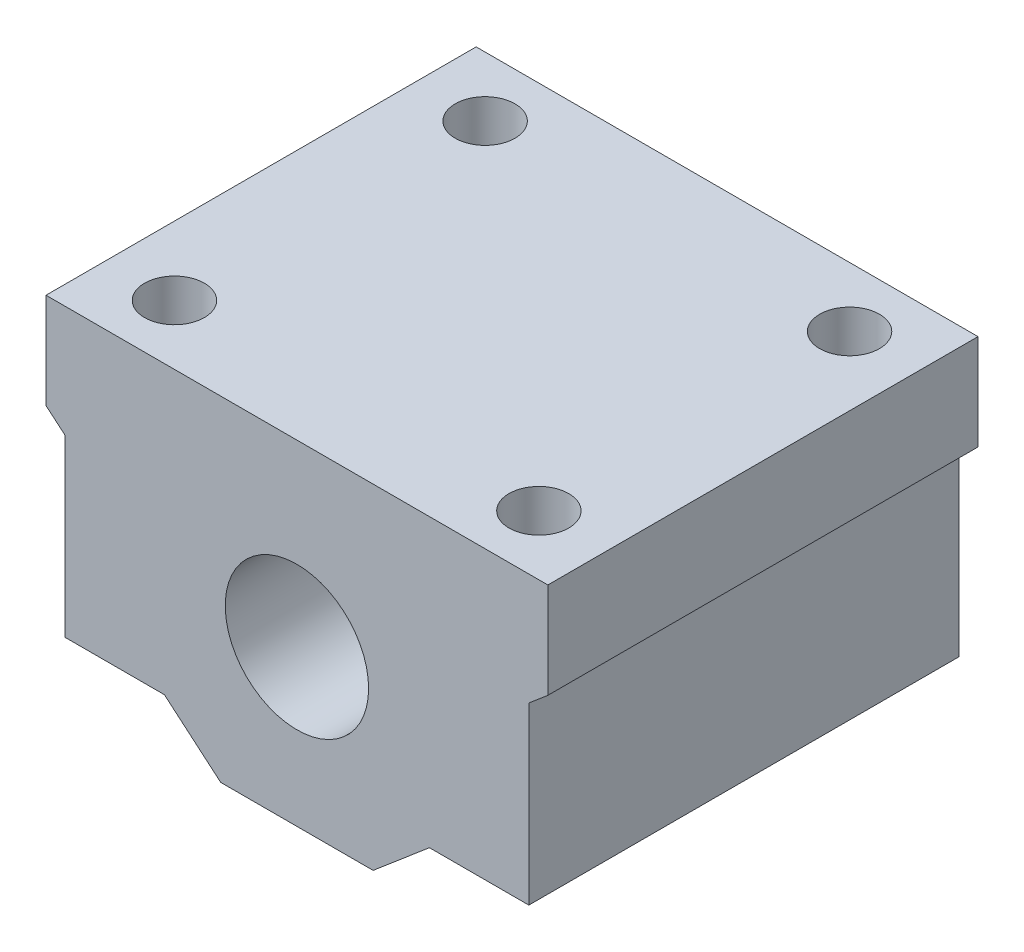
ISO-10303-21;
HEADER;
FILE_DESCRIPTION(('STEP AP214'),'2;1');
FILE_NAME('part.step','',(''),(''),'','','');
FILE_SCHEMA(('AUTOMOTIVE_DESIGN { 1 0 10303 214 1 1 1 1 }'));
ENDSEC;
DATA;
#1=APPLICATION_CONTEXT('core data for automotive mechanical design processes');
#2=APPLICATION_PROTOCOL_DEFINITION('international standard','automotive_design',2000,#1);
#3=PRODUCT_CONTEXT('',#1,'mechanical');
#4=PRODUCT('Part','Part','',(#3));
#5=PRODUCT_RELATED_PRODUCT_CATEGORY('part','',(#4));
#6=PRODUCT_DEFINITION_FORMATION('','',#4);
#7=PRODUCT_DEFINITION_CONTEXT('part definition',#1,'design');
#8=PRODUCT_DEFINITION('design','',#6,#7);
#9=PRODUCT_DEFINITION_SHAPE('','',#8);
#10=(LENGTH_UNIT() NAMED_UNIT(*) SI_UNIT(.MILLI.,.METRE.));
#11=(NAMED_UNIT(*) PLANE_ANGLE_UNIT() SI_UNIT($,.RADIAN.));
#12=(NAMED_UNIT(*) SI_UNIT($,.STERADIAN.) SOLID_ANGLE_UNIT());
#13=UNCERTAINTY_MEASURE_WITH_UNIT(LENGTH_MEASURE(1.E-05),#10,'distance_accuracy_value','');
#14=(GEOMETRIC_REPRESENTATION_CONTEXT(3) GLOBAL_UNCERTAINTY_ASSIGNED_CONTEXT((#13)) GLOBAL_UNIT_ASSIGNED_CONTEXT((#10,
#11,#12)) REPRESENTATION_CONTEXT('',''));
#15=CARTESIAN_POINT('',(0.,0.,0.));
#16=DIRECTION('',(0.,0.,1.));
#17=DIRECTION('',(1.,0.,0.));
#18=AXIS2_PLACEMENT_3D('',#15,#16,#17);
#19=CARTESIAN_POINT('',(-6.37775609988276,-6.01212369315824,36.));
#20=DIRECTION('',(0.647214623965311,0.762307831866787,0.));
#21=DIRECTION('',(-0.762307831866787,0.647214623965311,0.));
#22=AXIS2_PLACEMENT_3D('',#19,#20,#21);
#23=PLANE('',#22);
#24=DIRECTION('',(0.762307831866787,-0.647214623965311,0.));
#25=VECTOR('',#24,1.);
#26=CARTESIAN_POINT('',(-6.37775609988276,-6.01212369315824,0.));
#27=LINE('',#26,#25);
#28=CARTESIAN_POINT('',(-11.0890701131313,-2.01212369315823,0.));
#29=VERTEX_POINT('',#28);
#30=CARTESIAN_POINT('',(-6.37775609988276,-6.01212369315824,0.));
#31=VERTEX_POINT('',#30);
#32=EDGE_CURVE('E166',#29,#31,#27,.T.);
#33=ORIENTED_EDGE('',*,*,#32,.T.);
#34=DIRECTION('',(0.,0.,-1.));
#35=VECTOR('',#34,1.);
#36=CARTESIAN_POINT('',(-6.37775609988276,-6.01212369315824,36.));
#37=LINE('',#36,#35);
#38=CARTESIAN_POINT('',(-6.37775609988276,-6.01212369315824,36.));
#39=VERTEX_POINT('',#38);
#40=EDGE_CURVE('E11',#39,#31,#37,.T.);
#41=ORIENTED_EDGE('',*,*,#40,.F.);
#42=DIRECTION('',(0.762307831866787,-0.647214623965311,0.));
#43=VECTOR('',#42,1.);
#44=CARTESIAN_POINT('',(-6.37775609988276,-6.01212369315824,36.));
#45=LINE('',#44,#43);
#46=CARTESIAN_POINT('',(-11.0890701131313,-2.01212369315823,36.));
#47=VERTEX_POINT('',#46);
#48=EDGE_CURVE('E201',#47,#39,#45,.T.);
#49=ORIENTED_EDGE('',*,*,#48,.F.);
#50=DIRECTION('',(0.,0.,-1.));
#51=VECTOR('',#50,1.);
#52=CARTESIAN_POINT('',(-11.0890701131313,-2.01212369315823,36.));
#53=LINE('',#52,#51);
#54=EDGE_CURVE('E162',#47,#29,#53,.T.);
#55=ORIENTED_EDGE('',*,*,#54,.T.);
#56=EDGE_LOOP('',(#33,#41,#49,#55));
#57=FACE_BOUND('',#56,.T.);
#58=ADVANCED_FACE('F39',(#57),#23,.F.);
#59=CARTESIAN_POINT('',(6.37775609988276,-6.01212369315824,36.));
#60=DIRECTION('',(0.,1.,0.));
#61=DIRECTION('',(0.,0.,1.));
#62=AXIS2_PLACEMENT_3D('',#59,#60,#61);
#63=PLANE('',#62);
#64=DIRECTION('',(1.,0.,0.));
#65=VECTOR('',#64,1.);
#66=CARTESIAN_POINT('',(6.37775609988276,-6.01212369315824,0.));
#67=LINE('',#66,#65);
#68=CARTESIAN_POINT('',(6.37775609988276,-6.01212369315824,0.));
#69=VERTEX_POINT('',#68);
#70=EDGE_CURVE('E170',#31,#69,#67,.T.);
#71=ORIENTED_EDGE('',*,*,#70,.T.);
#72=DIRECTION('',(0.,0.,-1.));
#73=VECTOR('',#72,1.);
#74=CARTESIAN_POINT('',(6.37775609988276,-6.01212369315824,36.));
#75=LINE('',#74,#73);
#76=CARTESIAN_POINT('',(6.37775609988276,-6.01212369315824,36.));
#77=VERTEX_POINT('',#76);
#78=EDGE_CURVE('E49',#77,#69,#75,.T.);
#79=ORIENTED_EDGE('',*,*,#78,.F.);
#80=DIRECTION('',(1.,0.,0.));
#81=VECTOR('',#80,1.);
#82=CARTESIAN_POINT('',(6.37775609988276,-6.01212369315824,36.));
#83=LINE('',#82,#81);
#84=EDGE_CURVE('E113',#39,#77,#83,.T.);
#85=ORIENTED_EDGE('',*,*,#84,.F.);
#86=ORIENTED_EDGE('',*,*,#40,.T.);
#87=EDGE_LOOP('',(#71,#79,#85,#86));
#88=FACE_BOUND('',#87,.T.);
#89=ADVANCED_FACE('F321',(#88),#63,.F.);
#90=CARTESIAN_POINT('',(6.37775609988276,-6.01212369315824,36.));
#91=DIRECTION('',(-0.647214623965311,0.762307831866787,0.));
#92=DIRECTION('',(-0.762307831866787,-0.647214623965311,0.));
#93=AXIS2_PLACEMENT_3D('',#90,#91,#92);
#94=PLANE('',#93);
#95=DIRECTION('',(0.762307831866787,0.647214623965311,0.));
#96=VECTOR('',#95,1.);
#97=CARTESIAN_POINT('',(6.37775609988276,-6.01212369315824,0.));
#98=LINE('',#97,#96);
#99=CARTESIAN_POINT('',(11.0890701131313,-2.01212369315823,0.));
#100=VERTEX_POINT('',#99);
#101=EDGE_CURVE('E174',#69,#100,#98,.T.);
#102=ORIENTED_EDGE('',*,*,#101,.T.);
#103=DIRECTION('',(0.,0.,-1.));
#104=VECTOR('',#103,1.);
#105=CARTESIAN_POINT('',(11.0890701131313,-2.01212369315823,36.));
#106=LINE('',#105,#104);
#107=CARTESIAN_POINT('',(11.0890701131313,-2.01212369315823,36.));
#108=VERTEX_POINT('',#107);
#109=EDGE_CURVE('E228',#108,#100,#106,.T.);
#110=ORIENTED_EDGE('',*,*,#109,.F.);
#111=DIRECTION('',(0.762307831866787,0.647214623965311,0.));
#112=VECTOR('',#111,1.);
#113=CARTESIAN_POINT('',(6.37775609988276,-6.01212369315824,36.));
#114=LINE('',#113,#112);
#115=EDGE_CURVE('E273',#77,#108,#114,.T.);
#116=ORIENTED_EDGE('',*,*,#115,.F.);
#117=ORIENTED_EDGE('',*,*,#78,.T.);
#118=EDGE_LOOP('',(#102,#110,#116,#117));
#119=FACE_BOUND('',#118,.T.);
#120=ADVANCED_FACE('F325',(#119),#94,.F.);
#121=CARTESIAN_POINT('',(11.0890701131313,-2.01212369315823,36.));
#122=DIRECTION('',(0.,1.,0.));
#123=DIRECTION('',(-1.,0.,0.));
#124=AXIS2_PLACEMENT_3D('',#121,#122,#123);
#125=PLANE('',#124);
#126=CARTESIAN_POINT('',(15.25,-2.01212369315823,5.));
#127=DIRECTION('',(0.,1.,0.));
#128=DIRECTION('',(-1.,0.,0.));
#129=AXIS2_PLACEMENT_3D('',#126,#127,#128);
#130=CIRCLE('',#129,2.5);
#131=CARTESIAN_POINT('',(12.75,-2.01212369315823,5.));
#132=VERTEX_POINT('',#131);
#133=EDGE_CURVE('E258',#132,#132,#130,.T.);
#134=ORIENTED_EDGE('',*,*,#133,.T.);
#135=EDGE_LOOP('',(#134));
#136=FACE_BOUND('',#135,.T.);
#137=CARTESIAN_POINT('',(15.25,-2.01212369315823,31.));
#138=DIRECTION('',(0.,1.,0.));
#139=DIRECTION('',(-1.,0.,0.));
#140=AXIS2_PLACEMENT_3D('',#137,#138,#139);
#141=CIRCLE('',#140,2.5);
#142=CARTESIAN_POINT('',(12.75,-2.01212369315823,31.));
#143=VERTEX_POINT('',#142);
#144=EDGE_CURVE('E243',#143,#143,#141,.T.);
#145=ORIENTED_EDGE('',*,*,#144,.T.);
#146=EDGE_LOOP('',(#145));
#147=FACE_BOUND('',#146,.T.);
#148=DIRECTION('',(1.,0.,0.));
#149=VECTOR('',#148,1.);
#150=CARTESIAN_POINT('',(11.0890701131313,-2.01212369315823,0.));
#151=LINE('',#150,#149);
#152=CARTESIAN_POINT('',(19.4109298868687,-2.01212369315823,0.));
#153=VERTEX_POINT('',#152);
#154=EDGE_CURVE('E177',#100,#153,#151,.T.);
#155=ORIENTED_EDGE('',*,*,#154,.T.);
#156=DIRECTION('',(0.,0.,-1.));
#157=VECTOR('',#156,1.);
#158=CARTESIAN_POINT('',(19.4109298868687,-2.01212369315823,36.));
#159=LINE('',#158,#157);
#160=CARTESIAN_POINT('',(19.4109298868687,-2.01212369315823,36.));
#161=VERTEX_POINT('',#160);
#162=EDGE_CURVE('E224',#161,#153,#159,.T.);
#163=ORIENTED_EDGE('',*,*,#162,.F.);
#164=DIRECTION('',(1.,0.,0.));
#165=VECTOR('',#164,1.);
#166=CARTESIAN_POINT('',(11.0890701131313,-2.01212369315823,36.));
#167=LINE('',#166,#165);
#168=EDGE_CURVE('E276',#108,#161,#167,.T.);
#169=ORIENTED_EDGE('',*,*,#168,.F.);
#170=ORIENTED_EDGE('',*,*,#109,.T.);
#171=EDGE_LOOP('',(#155,#163,#169,#170));
#172=FACE_BOUND('',#171,.T.);
#173=ADVANCED_FACE('F329',(#136,#147,#172),#125,.F.);
#174=CARTESIAN_POINT('',(19.4109298868687,-2.01212369315823,36.));
#175=DIRECTION('',(-1.,0.,0.));
#176=DIRECTION('',(0.,0.,1.));
#177=AXIS2_PLACEMENT_3D('',#174,#175,#176);
#178=PLANE('',#177);
#179=DIRECTION('',(0.,1.,0.));
#180=VECTOR('',#179,1.);
#181=CARTESIAN_POINT('',(19.4109298868687,-2.01212369315823,0.));
#182=LINE('',#181,#180);
#183=CARTESIAN_POINT('',(19.4109298868687,12.6387239398692,0.));
#184=VERTEX_POINT('',#183);
#185=EDGE_CURVE('E180',#153,#184,#182,.T.);
#186=ORIENTED_EDGE('',*,*,#185,.T.);
#187=DIRECTION('',(0.,0.,-1.));
#188=VECTOR('',#187,1.);
#189=CARTESIAN_POINT('',(19.4109298868687,12.6387239398692,36.));
#190=LINE('',#189,#188);
#191=CARTESIAN_POINT('',(19.4109298868687,12.6387239398692,36.));
#192=VERTEX_POINT('',#191);
#193=EDGE_CURVE('E220',#192,#184,#190,.T.);
#194=ORIENTED_EDGE('',*,*,#193,.F.);
#195=DIRECTION('',(0.,1.,0.));
#196=VECTOR('',#195,1.);
#197=CARTESIAN_POINT('',(19.4109298868687,-2.01212369315823,36.));
#198=LINE('',#197,#196);
#199=EDGE_CURVE('E279',#161,#192,#198,.T.);
#200=ORIENTED_EDGE('',*,*,#199,.F.);
#201=ORIENTED_EDGE('',*,*,#162,.T.);
#202=EDGE_LOOP('',(#186,#194,#200,#201));
#203=FACE_BOUND('',#202,.T.);
#204=ADVANCED_FACE('F335',(#203),#178,.F.);
#205=CARTESIAN_POINT('',(19.4109298868687,12.6387239398692,36.));
#206=DIRECTION('',(-0.64721462396531,0.762307831866787,0.));
#207=DIRECTION('',(-0.762307831866787,-0.64721462396531,0.));
#208=AXIS2_PLACEMENT_3D('',#205,#206,#207);
#209=PLANE('',#208);
#210=DIRECTION('',(0.762307831866787,0.64721462396531,0.));
#211=VECTOR('',#210,1.);
#212=CARTESIAN_POINT('',(19.4109298868687,12.6387239398692,0.));
#213=LINE('',#212,#211);
#214=CARTESIAN_POINT('',(21.,13.9878763068418,0.));
#215=VERTEX_POINT('',#214);
#216=EDGE_CURVE('E183',#184,#215,#213,.T.);
#217=ORIENTED_EDGE('',*,*,#216,.T.);
#218=DIRECTION('',(0.,0.,-1.));
#219=VECTOR('',#218,1.);
#220=CARTESIAN_POINT('',(21.,13.9878763068418,36.));
#221=LINE('',#220,#219);
#222=CARTESIAN_POINT('',(21.,13.9878763068418,36.));
#223=VERTEX_POINT('',#222);
#224=EDGE_CURVE('E216',#223,#215,#221,.T.);
#225=ORIENTED_EDGE('',*,*,#224,.F.);
#226=DIRECTION('',(0.762307831866787,0.64721462396531,0.));
#227=VECTOR('',#226,1.);
#228=CARTESIAN_POINT('',(19.4109298868687,12.6387239398692,36.));
#229=LINE('',#228,#227);
#230=EDGE_CURVE('E282',#192,#223,#229,.T.);
#231=ORIENTED_EDGE('',*,*,#230,.F.);
#232=ORIENTED_EDGE('',*,*,#193,.T.);
#233=EDGE_LOOP('',(#217,#225,#231,#232));
#234=FACE_BOUND('',#233,.T.);
#235=ADVANCED_FACE('F339',(#234),#209,.F.);
#236=CARTESIAN_POINT('',(21.,13.9878763068418,36.));
#237=DIRECTION('',(-1.,0.,0.));
#238=DIRECTION('',(0.,-1.,0.));
#239=AXIS2_PLACEMENT_3D('',#236,#237,#238);
#240=PLANE('',#239);
#241=DIRECTION('',(0.,1.,0.));
#242=VECTOR('',#241,1.);
#243=CARTESIAN_POINT('',(21.,13.9878763068418,0.));
#244=LINE('',#243,#242);
#245=CARTESIAN_POINT('',(21.,21.9878763068418,0.));
#246=VERTEX_POINT('',#245);
#247=EDGE_CURVE('E186',#215,#246,#244,.T.);
#248=ORIENTED_EDGE('',*,*,#247,.T.);
#249=DIRECTION('',(0.,0.,-1.));
#250=VECTOR('',#249,1.);
#251=CARTESIAN_POINT('',(21.,21.9878763068418,36.));
#252=LINE('',#251,#250);
#253=CARTESIAN_POINT('',(21.,21.9878763068418,36.));
#254=VERTEX_POINT('',#253);
#255=EDGE_CURVE('E212',#254,#246,#252,.T.);
#256=ORIENTED_EDGE('',*,*,#255,.F.);
#257=DIRECTION('',(0.,1.,0.));
#258=VECTOR('',#257,1.);
#259=CARTESIAN_POINT('',(21.,13.9878763068418,36.));
#260=LINE('',#259,#258);
#261=EDGE_CURVE('E285',#223,#254,#260,.T.);
#262=ORIENTED_EDGE('',*,*,#261,.F.);
#263=ORIENTED_EDGE('',*,*,#224,.T.);
#264=EDGE_LOOP('',(#248,#256,#262,#263));
#265=FACE_BOUND('',#264,.T.);
#266=ADVANCED_FACE('F343',(#265),#240,.F.);
#267=CARTESIAN_POINT('',(-21.,21.9878763068418,36.));
#268=DIRECTION('',(0.,-1.,0.));
#269=DIRECTION('',(0.,0.,-1.));
#270=AXIS2_PLACEMENT_3D('',#267,#268,#269);
#271=PLANE('',#270);
#272=CARTESIAN_POINT('',(-15.25,21.9878763068418,31.));
#273=DIRECTION('',(0.,-1.,0.));
#274=DIRECTION('',(0.,0.,1.));
#275=AXIS2_PLACEMENT_3D('',#272,#273,#274);
#276=CIRCLE('',#275,2.5);
#277=CARTESIAN_POINT('',(-15.25,21.9878763068418,33.5));
#278=VERTEX_POINT('',#277);
#279=EDGE_CURVE('E245',#278,#278,#276,.T.);
#280=ORIENTED_EDGE('',*,*,#279,.T.);
#281=EDGE_LOOP('',(#280));
#282=FACE_BOUND('',#281,.T.);
#283=CARTESIAN_POINT('',(15.25,21.9878763068418,5.));
#284=DIRECTION('',(0.,-1.,0.));
#285=DIRECTION('',(0.,0.,1.));
#286=AXIS2_PLACEMENT_3D('',#283,#284,#285);
#287=CIRCLE('',#286,2.5);
#288=CARTESIAN_POINT('',(15.25,21.9878763068418,7.5));
#289=VERTEX_POINT('',#288);
#290=EDGE_CURVE('E251',#289,#289,#287,.T.);
#291=ORIENTED_EDGE('',*,*,#290,.T.);
#292=EDGE_LOOP('',(#291));
#293=FACE_BOUND('',#292,.T.);
#294=CARTESIAN_POINT('',(15.25,21.9878763068418,31.));
#295=DIRECTION('',(0.,-1.,0.));
#296=DIRECTION('',(0.,0.,-1.));
#297=AXIS2_PLACEMENT_3D('',#294,#295,#296);
#298=CIRCLE('',#297,2.5);
#299=CARTESIAN_POINT('',(15.25,21.9878763068418,28.5));
#300=VERTEX_POINT('',#299);
#301=EDGE_CURVE('E472',#300,#300,#298,.T.);
#302=ORIENTED_EDGE('',*,*,#301,.T.);
#303=EDGE_LOOP('',(#302));
#304=FACE_BOUND('',#303,.T.);
#305=CARTESIAN_POINT('',(-15.25,21.9878763068418,5.));
#306=DIRECTION('',(0.,-1.,0.));
#307=DIRECTION('',(0.,0.,-1.));
#308=AXIS2_PLACEMENT_3D('',#305,#306,#307);
#309=CIRCLE('',#308,2.5);
#310=CARTESIAN_POINT('',(-15.25,21.9878763068418,2.5));
#311=VERTEX_POINT('',#310);
#312=EDGE_CURVE('E237',#311,#311,#309,.T.);
#313=ORIENTED_EDGE('',*,*,#312,.T.);
#314=EDGE_LOOP('',(#313));
#315=FACE_BOUND('',#314,.T.);
#316=DIRECTION('',(-1.,0.,0.));
#317=VECTOR('',#316,1.);
#318=CARTESIAN_POINT('',(-21.,21.9878763068418,0.));
#319=LINE('',#318,#317);
#320=CARTESIAN_POINT('',(-21.,21.9878763068418,0.));
#321=VERTEX_POINT('',#320);
#322=EDGE_CURVE('E189',#246,#321,#319,.T.);
#323=ORIENTED_EDGE('',*,*,#322,.T.);
#324=DIRECTION('',(0.,0.,-1.));
#325=VECTOR('',#324,1.);
#326=CARTESIAN_POINT('',(-21.,21.9878763068418,36.));
#327=LINE('',#326,#325);
#328=CARTESIAN_POINT('',(-21.,21.9878763068418,36.));
#329=VERTEX_POINT('',#328);
#330=EDGE_CURVE('E208',#329,#321,#327,.T.);
#331=ORIENTED_EDGE('',*,*,#330,.F.);
#332=DIRECTION('',(-1.,0.,0.));
#333=VECTOR('',#332,1.);
#334=CARTESIAN_POINT('',(-21.,21.9878763068418,36.));
#335=LINE('',#334,#333);
#336=EDGE_CURVE('E288',#254,#329,#335,.T.);
#337=ORIENTED_EDGE('',*,*,#336,.F.);
#338=ORIENTED_EDGE('',*,*,#255,.T.);
#339=EDGE_LOOP('',(#323,#331,#337,#338));
#340=FACE_BOUND('',#339,.T.);
#341=ADVANCED_FACE('F296',(#282,#293,#304,#315,#340),#271,.F.);
#342=CARTESIAN_POINT('',(-21.,13.9878763068418,36.));
#343=DIRECTION('',(1.,0.,0.));
#344=DIRECTION('',(0.,1.,0.));
#345=AXIS2_PLACEMENT_3D('',#342,#343,#344);
#346=PLANE('',#345);
#347=DIRECTION('',(0.,-1.,0.));
#348=VECTOR('',#347,1.);
#349=CARTESIAN_POINT('',(-21.,13.9878763068418,0.));
#350=LINE('',#349,#348);
#351=CARTESIAN_POINT('',(-21.,13.9878763068418,0.));
#352=VERTEX_POINT('',#351);
#353=EDGE_CURVE('E192',#321,#352,#350,.T.);
#354=ORIENTED_EDGE('',*,*,#353,.T.);
#355=DIRECTION('',(0.,0.,-1.));
#356=VECTOR('',#355,1.);
#357=CARTESIAN_POINT('',(-21.,13.9878763068418,36.));
#358=LINE('',#357,#356);
#359=CARTESIAN_POINT('',(-21.,13.9878763068418,36.));
#360=VERTEX_POINT('',#359);
#361=EDGE_CURVE('E155',#360,#352,#358,.T.);
#362=ORIENTED_EDGE('',*,*,#361,.F.);
#363=DIRECTION('',(0.,-1.,0.));
#364=VECTOR('',#363,1.);
#365=CARTESIAN_POINT('',(-21.,13.9878763068418,36.));
#366=LINE('',#365,#364);
#367=EDGE_CURVE('E144',#329,#360,#366,.T.);
#368=ORIENTED_EDGE('',*,*,#367,.F.);
#369=ORIENTED_EDGE('',*,*,#330,.T.);
#370=EDGE_LOOP('',(#354,#362,#368,#369));
#371=FACE_BOUND('',#370,.T.);
#372=ADVANCED_FACE('F300',(#371),#346,.F.);
#373=CARTESIAN_POINT('',(-19.4109298868687,12.6387239398692,36.));
#374=DIRECTION('',(0.64721462396531,0.762307831866787,0.));
#375=DIRECTION('',(-0.762307831866787,0.64721462396531,0.));
#376=AXIS2_PLACEMENT_3D('',#373,#374,#375);
#377=PLANE('',#376);
#378=DIRECTION('',(0.762307831866787,-0.64721462396531,0.));
#379=VECTOR('',#378,1.);
#380=CARTESIAN_POINT('',(-19.4109298868687,12.6387239398692,0.));
#381=LINE('',#380,#379);
#382=CARTESIAN_POINT('',(-19.4109298868687,12.6387239398692,0.));
#383=VERTEX_POINT('',#382);
#384=EDGE_CURVE('E153',#352,#383,#381,.T.);
#385=ORIENTED_EDGE('',*,*,#384,.T.);
#386=DIRECTION('',(0.,0.,-1.));
#387=VECTOR('',#386,1.);
#388=CARTESIAN_POINT('',(-19.4109298868687,12.6387239398692,36.));
#389=LINE('',#388,#387);
#390=CARTESIAN_POINT('',(-19.4109298868687,12.6387239398692,36.));
#391=VERTEX_POINT('',#390);
#392=EDGE_CURVE('E150',#391,#383,#389,.T.);
#393=ORIENTED_EDGE('',*,*,#392,.F.);
#394=DIRECTION('',(0.762307831866787,-0.64721462396531,0.));
#395=VECTOR('',#394,1.);
#396=CARTESIAN_POINT('',(-19.4109298868687,12.6387239398692,36.));
#397=LINE('',#396,#395);
#398=EDGE_CURVE('E138',#360,#391,#397,.T.);
#399=ORIENTED_EDGE('',*,*,#398,.F.);
#400=ORIENTED_EDGE('',*,*,#361,.T.);
#401=EDGE_LOOP('',(#385,#393,#399,#400));
#402=FACE_BOUND('',#401,.T.);
#403=ADVANCED_FACE('F151',(#402),#377,.F.);
#404=CARTESIAN_POINT('',(-19.4109298868687,-2.01212369315823,36.));
#405=DIRECTION('',(1.,0.,0.));
#406=DIRECTION('',(0.,0.,-1.));
#407=AXIS2_PLACEMENT_3D('',#404,#405,#406);
#408=PLANE('',#407);
#409=DIRECTION('',(0.,-1.,0.));
#410=VECTOR('',#409,1.);
#411=CARTESIAN_POINT('',(-19.4109298868687,-2.01212369315823,0.));
#412=LINE('',#411,#410);
#413=CARTESIAN_POINT('',(-19.4109298868687,-2.01212369315823,0.));
#414=VERTEX_POINT('',#413);
#415=EDGE_CURVE('E99',#383,#414,#412,.T.);
#416=ORIENTED_EDGE('',*,*,#415,.T.);
#417=DIRECTION('',(0.,0.,-1.));
#418=VECTOR('',#417,1.);
#419=CARTESIAN_POINT('',(-19.4109298868687,-2.01212369315823,36.));
#420=LINE('',#419,#418);
#421=CARTESIAN_POINT('',(-19.4109298868687,-2.01212369315823,36.));
#422=VERTEX_POINT('',#421);
#423=EDGE_CURVE('E156',#422,#414,#420,.T.);
#424=ORIENTED_EDGE('',*,*,#423,.F.);
#425=DIRECTION('',(0.,-1.,0.));
#426=VECTOR('',#425,1.);
#427=CARTESIAN_POINT('',(-19.4109298868687,-2.01212369315823,36.));
#428=LINE('',#427,#426);
#429=EDGE_CURVE('E142',#391,#422,#428,.T.);
#430=ORIENTED_EDGE('',*,*,#429,.F.);
#431=ORIENTED_EDGE('',*,*,#392,.T.);
#432=EDGE_LOOP('',(#416,#424,#430,#431));
#433=FACE_BOUND('',#432,.T.);
#434=ADVANCED_FACE('F158',(#433),#408,.F.);
#435=CARTESIAN_POINT('',(-11.0890701131313,-2.01212369315823,36.));
#436=DIRECTION('',(0.,1.,0.));
#437=DIRECTION('',(-1.,0.,0.));
#438=AXIS2_PLACEMENT_3D('',#435,#436,#437);
#439=PLANE('',#438);
#440=CARTESIAN_POINT('',(-15.25,-2.01212369315823,31.));
#441=DIRECTION('',(0.,1.,0.));
#442=DIRECTION('',(-1.,0.,0.));
#443=AXIS2_PLACEMENT_3D('',#440,#441,#442);
#444=CIRCLE('',#443,2.5);
#445=CARTESIAN_POINT('',(-17.75,-2.01212369315823,31.));
#446=VERTEX_POINT('',#445);
#447=EDGE_CURVE('E42',#446,#446,#444,.T.);
#448=ORIENTED_EDGE('',*,*,#447,.T.);
#449=EDGE_LOOP('',(#448));
#450=FACE_BOUND('',#449,.T.);
#451=CARTESIAN_POINT('',(-15.25,-2.01212369315823,5.));
#452=DIRECTION('',(0.,1.,0.));
#453=DIRECTION('',(-1.,0.,0.));
#454=AXIS2_PLACEMENT_3D('',#451,#452,#453);
#455=CIRCLE('',#454,2.5);
#456=CARTESIAN_POINT('',(-17.75,-2.01212369315823,5.));
#457=VERTEX_POINT('',#456);
#458=EDGE_CURVE('E234',#457,#457,#455,.T.);
#459=ORIENTED_EDGE('',*,*,#458,.T.);
#460=EDGE_LOOP('',(#459));
#461=FACE_BOUND('',#460,.T.);
#462=DIRECTION('',(1.,0.,0.));
#463=VECTOR('',#462,1.);
#464=CARTESIAN_POINT('',(-11.0890701131313,-2.01212369315823,0.));
#465=LINE('',#464,#463);
#466=EDGE_CURVE('E105',#414,#29,#465,.T.);
#467=ORIENTED_EDGE('',*,*,#466,.T.);
#468=ORIENTED_EDGE('',*,*,#54,.F.);
#469=DIRECTION('',(1.,0.,0.));
#470=VECTOR('',#469,1.);
#471=CARTESIAN_POINT('',(-11.0890701131313,-2.01212369315823,36.));
#472=LINE('',#471,#470);
#473=EDGE_CURVE('E58',#422,#47,#472,.T.);
#474=ORIENTED_EDGE('',*,*,#473,.F.);
#475=ORIENTED_EDGE('',*,*,#423,.T.);
#476=EDGE_LOOP('',(#467,#468,#474,#475));
#477=FACE_BOUND('',#476,.T.);
#478=ADVANCED_FACE('F308',(#450,#461,#477),#439,.F.);
#479=CARTESIAN_POINT('',(0.,0.,36.));
#480=DIRECTION('',(0.,0.,-1.));
#481=DIRECTION('',(-1.,0.,0.));
#482=AXIS2_PLACEMENT_3D('',#479,#480,#481);
#483=PLANE('',#482);
#484=CARTESIAN_POINT('',(0.,6.98787630684177,36.));
#485=DIRECTION('',(0.,0.,1.));
#486=DIRECTION('',(1.,0.,0.));
#487=AXIS2_PLACEMENT_3D('',#484,#485,#486);
#488=CIRCLE('',#487,6.);
#489=CARTESIAN_POINT('',(6.,6.98787630684177,36.));
#490=VERTEX_POINT('',#489);
#491=EDGE_CURVE('E262',#490,#490,#488,.T.);
#492=ORIENTED_EDGE('',*,*,#491,.F.);
#493=EDGE_LOOP('',(#492));
#494=FACE_BOUND('',#493,.T.);
#495=ORIENTED_EDGE('',*,*,#48,.T.);
#496=ORIENTED_EDGE('',*,*,#84,.T.);
#497=ORIENTED_EDGE('',*,*,#115,.T.);
#498=ORIENTED_EDGE('',*,*,#168,.T.);
#499=ORIENTED_EDGE('',*,*,#199,.T.);
#500=ORIENTED_EDGE('',*,*,#230,.T.);
#501=ORIENTED_EDGE('',*,*,#261,.T.);
#502=ORIENTED_EDGE('',*,*,#336,.T.);
#503=ORIENTED_EDGE('',*,*,#367,.T.);
#504=ORIENTED_EDGE('',*,*,#398,.T.);
#505=ORIENTED_EDGE('',*,*,#429,.T.);
#506=ORIENTED_EDGE('',*,*,#473,.T.);
#507=EDGE_LOOP('',(#495,#496,#497,#498,#499,#500,#501,#502,#503,#504,#505,#506));
#508=FACE_BOUND('',#507,.T.);
#509=ADVANCED_FACE('F140',(#494,#508),#483,.F.);
#510=CARTESIAN_POINT('',(0.,0.,0.));
#511=DIRECTION('',(0.,0.,-1.));
#512=DIRECTION('',(-1.,0.,0.));
#513=AXIS2_PLACEMENT_3D('',#510,#511,#512);
#514=PLANE('',#513);
#515=CARTESIAN_POINT('',(0.,6.98787630684177,0.));
#516=DIRECTION('',(0.,0.,1.));
#517=DIRECTION('',(1.,0.,0.));
#518=AXIS2_PLACEMENT_3D('',#515,#516,#517);
#519=CIRCLE('',#518,6.);
#520=CARTESIAN_POINT('',(6.,6.98787630684177,0.));
#521=VERTEX_POINT('',#520);
#522=EDGE_CURVE('E171',#521,#521,#519,.T.);
#523=ORIENTED_EDGE('',*,*,#522,.T.);
#524=EDGE_LOOP('',(#523));
#525=FACE_BOUND('',#524,.T.);
#526=ORIENTED_EDGE('',*,*,#32,.F.);
#527=ORIENTED_EDGE('',*,*,#466,.F.);
#528=ORIENTED_EDGE('',*,*,#415,.F.);
#529=ORIENTED_EDGE('',*,*,#384,.F.);
#530=ORIENTED_EDGE('',*,*,#353,.F.);
#531=ORIENTED_EDGE('',*,*,#322,.F.);
#532=ORIENTED_EDGE('',*,*,#247,.F.);
#533=ORIENTED_EDGE('',*,*,#216,.F.);
#534=ORIENTED_EDGE('',*,*,#185,.F.);
#535=ORIENTED_EDGE('',*,*,#154,.F.);
#536=ORIENTED_EDGE('',*,*,#101,.F.);
#537=ORIENTED_EDGE('',*,*,#70,.F.);
#538=EDGE_LOOP('',(#526,#527,#528,#529,#530,#531,#532,#533,#534,#535,#536,#537));
#539=FACE_BOUND('',#538,.T.);
#540=ADVANCED_FACE('F303',(#525,#539),#514,.T.);
#541=CARTESIAN_POINT('',(0.,6.98787630684177,0.));
#542=DIRECTION('',(0.,0.,1.));
#543=DIRECTION('',(1.,0.,0.));
#544=AXIS2_PLACEMENT_3D('',#541,#542,#543);
#545=CYLINDRICAL_SURFACE('',#544,6.);
#546=ORIENTED_EDGE('',*,*,#522,.F.);
#547=EDGE_LOOP('',(#546));
#548=FACE_BOUND('',#547,.T.);
#549=ORIENTED_EDGE('',*,*,#491,.T.);
#550=EDGE_LOOP('',(#549));
#551=FACE_BOUND('',#550,.T.);
#552=ADVANCED_FACE('F378',(#548,#551),#545,.F.);
#553=CARTESIAN_POINT('',(-15.25,21.9878763068418,5.));
#554=DIRECTION('',(0.,-1.,0.));
#555=DIRECTION('',(0.,0.,-1.));
#556=AXIS2_PLACEMENT_3D('',#553,#554,#555);
#557=CYLINDRICAL_SURFACE('',#556,2.5);
#558=ORIENTED_EDGE('',*,*,#312,.F.);
#559=EDGE_LOOP('',(#558));
#560=FACE_BOUND('',#559,.T.);
#561=ORIENTED_EDGE('',*,*,#458,.F.);
#562=EDGE_LOOP('',(#561));
#563=FACE_BOUND('',#562,.T.);
#564=ADVANCED_FACE('F387',(#560,#563),#557,.F.);
#565=CARTESIAN_POINT('',(-15.25,21.9878763068418,31.));
#566=DIRECTION('',(0.,-1.,0.));
#567=DIRECTION('',(0.,0.,-1.));
#568=AXIS2_PLACEMENT_3D('',#565,#566,#567);
#569=CYLINDRICAL_SURFACE('',#568,2.5);
#570=ORIENTED_EDGE('',*,*,#279,.F.);
#571=EDGE_LOOP('',(#570));
#572=FACE_BOUND('',#571,.T.);
#573=ORIENTED_EDGE('',*,*,#447,.F.);
#574=EDGE_LOOP('',(#573));
#575=FACE_BOUND('',#574,.T.);
#576=ADVANCED_FACE('F416',(#572,#575),#569,.F.);
#577=CARTESIAN_POINT('',(15.25,21.9878763068418,31.));
#578=DIRECTION('',(0.,-1.,0.));
#579=DIRECTION('',(0.,0.,-1.));
#580=AXIS2_PLACEMENT_3D('',#577,#578,#579);
#581=CYLINDRICAL_SURFACE('',#580,2.5);
#582=ORIENTED_EDGE('',*,*,#301,.F.);
#583=EDGE_LOOP('',(#582));
#584=FACE_BOUND('',#583,.T.);
#585=ORIENTED_EDGE('',*,*,#144,.F.);
#586=EDGE_LOOP('',(#585));
#587=FACE_BOUND('',#586,.T.);
#588=ADVANCED_FACE('F426',(#584,#587),#581,.F.);
#589=CARTESIAN_POINT('',(15.25,21.9878763068418,5.));
#590=DIRECTION('',(0.,-1.,0.));
#591=DIRECTION('',(0.,0.,-1.));
#592=AXIS2_PLACEMENT_3D('',#589,#590,#591);
#593=CYLINDRICAL_SURFACE('',#592,2.5);
#594=ORIENTED_EDGE('',*,*,#290,.F.);
#595=EDGE_LOOP('',(#594));
#596=FACE_BOUND('',#595,.T.);
#597=ORIENTED_EDGE('',*,*,#133,.F.);
#598=EDGE_LOOP('',(#597));
#599=FACE_BOUND('',#598,.T.);
#600=ADVANCED_FACE('F436',(#596,#599),#593,.F.);
#601=CLOSED_SHELL('',(#58,#89,#120,#173,#204,#235,#266,#341,#372,#403,#434,#478,#509,#540,#552,
#564,#576,#588,#600));
#602=MANIFOLD_SOLID_BREP('B2',#601);
#603=ADVANCED_BREP_SHAPE_REPRESENTATION('',(#18,#602),#14);
#604=SHAPE_DEFINITION_REPRESENTATION(#9,#603);
ENDSEC;
END-ISO-10303-21;
